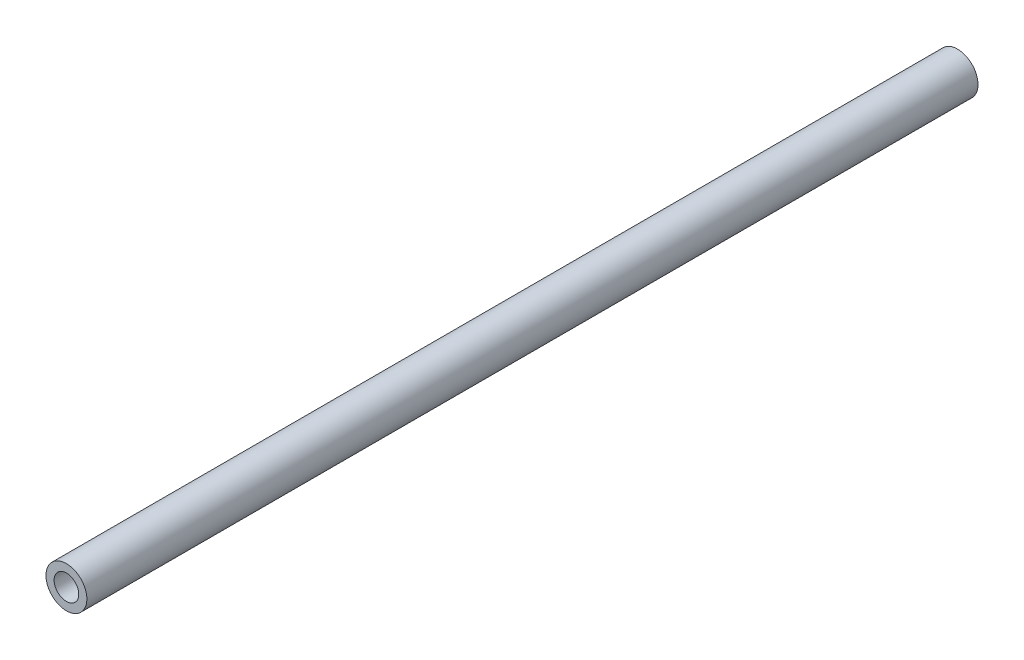
ISO-10303-21;
HEADER;
FILE_DESCRIPTION(('STEP AP214'),'2;1');
FILE_NAME('part.step','',(''),(''),'','','');
FILE_SCHEMA(('AUTOMOTIVE_DESIGN { 1 0 10303 214 1 1 1 1 }'));
ENDSEC;
DATA;
#1=APPLICATION_CONTEXT('core data for automotive mechanical design processes');
#2=APPLICATION_PROTOCOL_DEFINITION('international standard','automotive_design',2000,#1);
#3=PRODUCT_CONTEXT('',#1,'mechanical');
#4=PRODUCT('Part','Part','',(#3));
#5=PRODUCT_RELATED_PRODUCT_CATEGORY('part','',(#4));
#6=PRODUCT_DEFINITION_FORMATION('','',#4);
#7=PRODUCT_DEFINITION_CONTEXT('part definition',#1,'design');
#8=PRODUCT_DEFINITION('design','',#6,#7);
#9=PRODUCT_DEFINITION_SHAPE('','',#8);
#10=(LENGTH_UNIT() NAMED_UNIT(*) SI_UNIT(.MILLI.,.METRE.));
#11=(NAMED_UNIT(*) PLANE_ANGLE_UNIT() SI_UNIT($,.RADIAN.));
#12=(NAMED_UNIT(*) SI_UNIT($,.STERADIAN.) SOLID_ANGLE_UNIT());
#13=UNCERTAINTY_MEASURE_WITH_UNIT(LENGTH_MEASURE(1.E-05),#10,'distance_accuracy_value','');
#14=(GEOMETRIC_REPRESENTATION_CONTEXT(3) GLOBAL_UNCERTAINTY_ASSIGNED_CONTEXT((#13)) GLOBAL_UNIT_ASSIGNED_CONTEXT((#10,
#11,#12)) REPRESENTATION_CONTEXT('',''));
#15=CARTESIAN_POINT('',(0.,0.,0.));
#16=DIRECTION('',(0.,0.,1.));
#17=DIRECTION('',(1.,0.,0.));
#18=AXIS2_PLACEMENT_3D('',#15,#16,#17);
#19=CARTESIAN_POINT('',(-14.7938519306559,11.597649353045,558.8));
#20=DIRECTION('',(0.,0.,1.));
#21=DIRECTION('',(1.,0.,0.));
#22=AXIS2_PLACEMENT_3D('',#19,#20,#21);
#23=PLANE('',#22);
#24=CARTESIAN_POINT('',(-14.7938519306559,11.597649353045,558.8));
#25=DIRECTION('',(0.,0.,1.));
#26=DIRECTION('',(1.,0.,0.));
#27=AXIS2_PLACEMENT_3D('',#24,#25,#26);
#28=CIRCLE('',#27,12.8268137734498);
#29=CARTESIAN_POINT('',(-1.96703815720611,11.597649353045,558.8));
#30=VERTEX_POINT('',#29);
#31=EDGE_CURVE('E10',#30,#30,#28,.T.);
#32=ORIENTED_EDGE('',*,*,#31,.T.);
#33=EDGE_LOOP('',(#32));
#34=FACE_BOUND('',#33,.T.);
#35=CARTESIAN_POINT('',(-14.7938519306559,11.597649353045,558.8));
#36=DIRECTION('',(0.,0.,1.));
#37=DIRECTION('',(1.,0.,0.));
#38=AXIS2_PLACEMENT_3D('',#35,#36,#37);
#39=CIRCLE('',#38,7.73144538176072);
#40=CARTESIAN_POINT('',(-7.06240654889517,11.597649353045,558.8));
#41=VERTEX_POINT('',#40);
#42=EDGE_CURVE('E52',#41,#41,#39,.T.);
#43=ORIENTED_EDGE('',*,*,#42,.F.);
#44=EDGE_LOOP('',(#43));
#45=FACE_BOUND('',#44,.T.);
#46=ADVANCED_FACE('F39',(#34,#45),#23,.T.);
#47=CARTESIAN_POINT('',(-14.7938519306559,11.597649353045,0.));
#48=DIRECTION('',(0.,0.,1.));
#49=DIRECTION('',(1.,0.,0.));
#50=AXIS2_PLACEMENT_3D('',#47,#48,#49);
#51=PLANE('',#50);
#52=CARTESIAN_POINT('',(-14.7938519306559,11.597649353045,0.));
#53=DIRECTION('',(0.,0.,1.));
#54=DIRECTION('',(1.,0.,0.));
#55=AXIS2_PLACEMENT_3D('',#52,#53,#54);
#56=CIRCLE('',#55,12.8268137734498);
#57=CARTESIAN_POINT('',(-1.96703815720611,11.597649353045,0.));
#58=VERTEX_POINT('',#57);
#59=EDGE_CURVE('E43',#58,#58,#56,.T.);
#60=ORIENTED_EDGE('',*,*,#59,.F.);
#61=EDGE_LOOP('',(#60));
#62=FACE_BOUND('',#61,.T.);
#63=CARTESIAN_POINT('',(-14.7938519306559,11.597649353045,0.));
#64=DIRECTION('',(0.,0.,1.));
#65=DIRECTION('',(1.,0.,0.));
#66=AXIS2_PLACEMENT_3D('',#63,#64,#65);
#67=CIRCLE('',#66,7.73144538176072);
#68=CARTESIAN_POINT('',(-7.06240654889517,11.597649353045,0.));
#69=VERTEX_POINT('',#68);
#70=EDGE_CURVE('E54',#69,#69,#67,.T.);
#71=ORIENTED_EDGE('',*,*,#70,.T.);
#72=EDGE_LOOP('',(#71));
#73=FACE_BOUND('',#72,.T.);
#74=ADVANCED_FACE('F66',(#62,#73),#51,.F.);
#75=CARTESIAN_POINT('',(-14.7938519306559,11.597649353045,558.8));
#76=DIRECTION('',(0.,0.,-1.));
#77=DIRECTION('',(-1.,0.,0.));
#78=AXIS2_PLACEMENT_3D('',#75,#76,#77);
#79=CYLINDRICAL_SURFACE('',#78,12.8268137734498);
#80=ORIENTED_EDGE('',*,*,#31,.F.);
#81=EDGE_LOOP('',(#80));
#82=FACE_BOUND('',#81,.T.);
#83=ORIENTED_EDGE('',*,*,#59,.T.);
#84=EDGE_LOOP('',(#83));
#85=FACE_BOUND('',#84,.T.);
#86=ADVANCED_FACE('F41',(#82,#85),#79,.T.);
#87=CARTESIAN_POINT('',(-14.7938519306559,11.597649353045,558.8));
#88=DIRECTION('',(0.,0.,-1.));
#89=DIRECTION('',(-1.,0.,0.));
#90=AXIS2_PLACEMENT_3D('',#87,#88,#89);
#91=CYLINDRICAL_SURFACE('',#90,7.73144538176072);
#92=ORIENTED_EDGE('',*,*,#42,.T.);
#93=EDGE_LOOP('',(#92));
#94=FACE_BOUND('',#93,.T.);
#95=ORIENTED_EDGE('',*,*,#70,.F.);
#96=EDGE_LOOP('',(#95));
#97=FACE_BOUND('',#96,.T.);
#98=ADVANCED_FACE('F62',(#94,#97),#91,.F.);
#99=CLOSED_SHELL('',(#46,#74,#86,#98));
#100=MANIFOLD_SOLID_BREP('B2',#99);
#101=ADVANCED_BREP_SHAPE_REPRESENTATION('',(#18,#100),#14);
#102=SHAPE_DEFINITION_REPRESENTATION(#9,#101);
ENDSEC;
END-ISO-10303-21;
